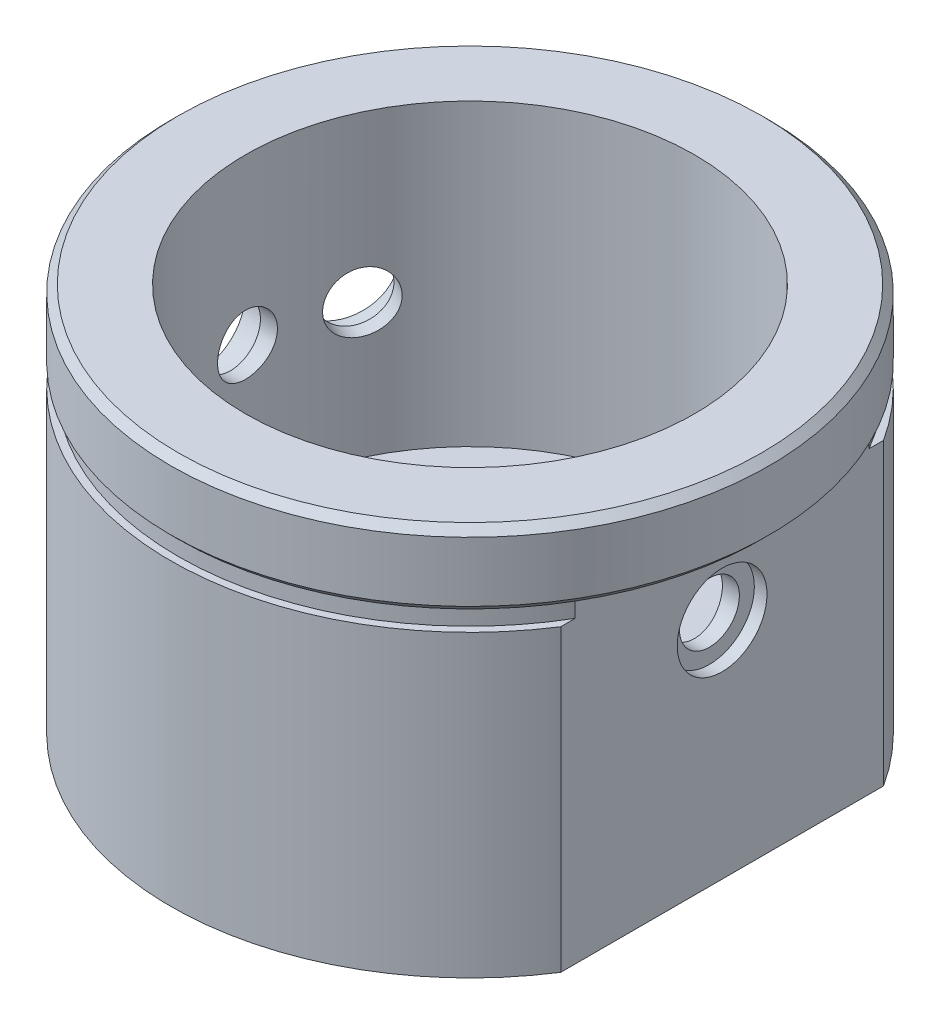
ISO-10303-21;
HEADER;
FILE_DESCRIPTION(('STEP AP214'),'2;1');
FILE_NAME('part.step','',(''),(''),'','','');
FILE_SCHEMA(('AUTOMOTIVE_DESIGN { 1 0 10303 214 1 1 1 1 }'));
ENDSEC;
DATA;
#1=APPLICATION_CONTEXT('core data for automotive mechanical design processes');
#2=APPLICATION_PROTOCOL_DEFINITION('international standard','automotive_design',2000,#1);
#3=PRODUCT_CONTEXT('',#1,'mechanical');
#4=PRODUCT('Part','Part','',(#3));
#5=PRODUCT_RELATED_PRODUCT_CATEGORY('part','',(#4));
#6=PRODUCT_DEFINITION_FORMATION('','',#4);
#7=PRODUCT_DEFINITION_CONTEXT('part definition',#1,'design');
#8=PRODUCT_DEFINITION('design','',#6,#7);
#9=PRODUCT_DEFINITION_SHAPE('','',#8);
#10=(LENGTH_UNIT() NAMED_UNIT(*) SI_UNIT(.MILLI.,.METRE.));
#11=(NAMED_UNIT(*) PLANE_ANGLE_UNIT() SI_UNIT($,.RADIAN.));
#12=(NAMED_UNIT(*) SI_UNIT($,.STERADIAN.) SOLID_ANGLE_UNIT());
#13=UNCERTAINTY_MEASURE_WITH_UNIT(LENGTH_MEASURE(1.E-05),#10,'distance_accuracy_value','');
#14=(GEOMETRIC_REPRESENTATION_CONTEXT(3) GLOBAL_UNCERTAINTY_ASSIGNED_CONTEXT((#13)) GLOBAL_UNIT_ASSIGNED_CONTEXT((#10,
#11,#12)) REPRESENTATION_CONTEXT('',''));
#15=CARTESIAN_POINT('',(0.,0.,0.));
#16=DIRECTION('',(0.,0.,1.));
#17=DIRECTION('',(1.,0.,0.));
#18=AXIS2_PLACEMENT_3D('',#15,#16,#17);
#19=CARTESIAN_POINT('',(0.,0.,0.));
#20=DIRECTION('',(0.,-1.,0.));
#21=DIRECTION('',(0.,0.,-1.));
#22=AXIS2_PLACEMENT_3D('',#19,#20,#21);
#23=CYLINDRICAL_SURFACE('',#22,19.5);
#24=CARTESIAN_POINT('',(0.,5.,0.));
#25=DIRECTION('',(0.,-1.,0.));
#26=DIRECTION('',(0.,0.,-1.));
#27=AXIS2_PLACEMENT_3D('',#24,#25,#26);
#28=CIRCLE('',#27,19.5);
#29=CARTESIAN_POINT('',(16.8456422437219,5.,9.82213507321768));
#30=VERTEX_POINT('',#29);
#31=CARTESIAN_POINT('',(-18.,5.,7.50000000000002));
#32=VERTEX_POINT('',#31);
#33=EDGE_CURVE('E145',#30,#32,#28,.T.);
#34=ORIENTED_EDGE('',*,*,#33,.F.);
#35=DIRECTION('',(0.,-1.,0.));
#36=VECTOR('',#35,1.);
#37=CARTESIAN_POINT('',(16.8456422437219,0.,9.82213507321768));
#38=LINE('',#37,#36);
#39=CARTESIAN_POINT('',(16.8456422437219,6.,9.82213507321769));
#40=VERTEX_POINT('',#39);
#41=EDGE_CURVE('E315',#30,#40,#38,.F.);
#42=ORIENTED_EDGE('',*,*,#41,.T.);
#43=CARTESIAN_POINT('',(0.,6.,0.));
#44=DIRECTION('',(0.,-1.,0.));
#45=DIRECTION('',(0.,0.,-1.));
#46=AXIS2_PLACEMENT_3D('',#43,#44,#45);
#47=CIRCLE('',#46,19.5);
#48=CARTESIAN_POINT('',(-18.,6.,7.50000000000006));
#49=VERTEX_POINT('',#48);
#50=EDGE_CURVE('E149',#40,#49,#47,.T.);
#51=ORIENTED_EDGE('',*,*,#50,.T.);
#52=DIRECTION('',(0.,-1.,0.));
#53=VECTOR('',#52,1.);
#54=CARTESIAN_POINT('',(-18.,0.,7.50000000000004));
#55=LINE('',#54,#53);
#56=EDGE_CURVE('E191',#49,#32,#55,.T.);
#57=ORIENTED_EDGE('',*,*,#56,.T.);
#58=EDGE_LOOP('',(#34,#42,#51,#57));
#59=FACE_BOUND('',#58,.T.);
#60=ADVANCED_FACE('F39',(#59),#23,.T.);
#61=CARTESIAN_POINT('',(-13.1439032036043,6.,-14.4044371141076));
#62=VERTEX_POINT('',#61);
#63=CARTESIAN_POINT('',(16.8456422437219,6.,-9.82213507321769));
#64=VERTEX_POINT('',#63);
#65=EDGE_CURVE('E154',#62,#64,#47,.T.);
#66=ORIENTED_EDGE('',*,*,#65,.T.);
#67=DIRECTION('',(0.,-1.,0.));
#68=VECTOR('',#67,1.);
#69=CARTESIAN_POINT('',(16.8456422437219,0.,-9.82213507321768));
#70=LINE('',#69,#68);
#71=CARTESIAN_POINT('',(16.8456422437219,5.,-9.82213507321768));
#72=VERTEX_POINT('',#71);
#73=EDGE_CURVE('E319',#64,#72,#70,.T.);
#74=ORIENTED_EDGE('',*,*,#73,.T.);
#75=CARTESIAN_POINT('',(-13.1439032036044,5.,-14.4044371141076));
#76=VERTEX_POINT('',#75);
#77=EDGE_CURVE('E146',#76,#72,#28,.T.);
#78=ORIENTED_EDGE('',*,*,#77,.F.);
#79=DIRECTION('',(0.,-1.,0.));
#80=VECTOR('',#79,1.);
#81=CARTESIAN_POINT('',(-13.1439032036043,0.,-14.4044371141076));
#82=LINE('',#81,#80);
#83=EDGE_CURVE('E197',#76,#62,#82,.F.);
#84=ORIENTED_EDGE('',*,*,#83,.T.);
#85=EDGE_LOOP('',(#66,#74,#78,#84));
#86=FACE_BOUND('',#85,.T.);
#87=ADVANCED_FACE('F277',(#86),#23,.T.);
#88=CARTESIAN_POINT('',(19.5,5.,0.));
#89=DIRECTION('',(0.,1.,0.));
#90=DIRECTION('',(0.,0.,1.));
#91=AXIS2_PLACEMENT_3D('',#88,#89,#90);
#92=PLANE('',#91);
#93=CARTESIAN_POINT('',(0.,5.,0.));
#94=DIRECTION('',(0.,-1.,0.));
#95=DIRECTION('',(0.,0.,-1.));
#96=AXIS2_PLACEMENT_3D('',#93,#94,#95);
#97=CIRCLE('',#96,20.);
#98=CARTESIAN_POINT('',(16.8456422437219,5.,10.7807391859989));
#99=VERTEX_POINT('',#98);
#100=CARTESIAN_POINT('',(-18.,5.,8.71779788708136));
#101=VERTEX_POINT('',#100);
#102=EDGE_CURVE('E138',#99,#101,#97,.T.);
#103=ORIENTED_EDGE('',*,*,#102,.F.);
#104=DIRECTION('',(0.,0.,-1.));
#105=VECTOR('',#104,1.);
#106=CARTESIAN_POINT('',(16.8456422437219,5.,0.));
#107=LINE('',#106,#105);
#108=EDGE_CURVE('E323',#99,#30,#107,.T.);
#109=ORIENTED_EDGE('',*,*,#108,.T.);
#110=ORIENTED_EDGE('',*,*,#33,.T.);
#111=DIRECTION('',(0.,0.,1.));
#112=VECTOR('',#111,1.);
#113=CARTESIAN_POINT('',(-18.,5.,0.));
#114=LINE('',#113,#112);
#115=EDGE_CURVE('E184',#32,#101,#114,.T.);
#116=ORIENTED_EDGE('',*,*,#115,.T.);
#117=EDGE_LOOP('',(#103,#109,#110,#116));
#118=FACE_BOUND('',#117,.T.);
#119=ADVANCED_FACE('F283',(#118),#92,.T.);
#120=ORIENTED_EDGE('',*,*,#77,.T.);
#121=CARTESIAN_POINT('',(16.8456422437219,5.,-10.7807391859989));
#122=VERTEX_POINT('',#121);
#123=EDGE_CURVE('E129',#72,#122,#107,.T.);
#124=ORIENTED_EDGE('',*,*,#123,.T.);
#125=CARTESIAN_POINT('',(-12.6292395774145,5.,-15.5081368222062));
#126=VERTEX_POINT('',#125);
#127=EDGE_CURVE('E128',#126,#122,#97,.T.);
#128=ORIENTED_EDGE('',*,*,#127,.F.);
#129=DIRECTION('',(-0.422618261740707,0.,0.906307787036646));
#130=VECTOR('',#129,1.);
#131=CARTESIAN_POINT('',(-12.8307193611033,5.,-15.0760620317429));
#132=LINE('',#131,#130);
#133=EDGE_CURVE('E194',#126,#76,#132,.T.);
#134=ORIENTED_EDGE('',*,*,#133,.T.);
#135=EDGE_LOOP('',(#120,#124,#128,#134));
#136=FACE_BOUND('',#135,.T.);
#137=ADVANCED_FACE('F321',(#136),#92,.T.);
#138=CARTESIAN_POINT('',(0.,0.,0.));
#139=DIRECTION('',(0.,-1.,0.));
#140=DIRECTION('',(0.,0.,-1.));
#141=AXIS2_PLACEMENT_3D('',#138,#139,#140);
#142=CYLINDRICAL_SURFACE('',#141,20.);
#143=CARTESIAN_POINT('',(0.,-15.,0.));
#144=DIRECTION('',(0.,-1.,0.));
#145=DIRECTION('',(0.,0.,-1.));
#146=AXIS2_PLACEMENT_3D('',#143,#144,#145);
#147=CIRCLE('',#146,20.);
#148=CARTESIAN_POINT('',(16.8456422437219,-15.,10.7807391859989));
#149=VERTEX_POINT('',#148);
#150=CARTESIAN_POINT('',(-18.,-15.,8.71779788708136));
#151=VERTEX_POINT('',#150);
#152=EDGE_CURVE('E135',#149,#151,#147,.T.);
#153=ORIENTED_EDGE('',*,*,#152,.F.);
#154=DIRECTION('',(0.,-1.,0.));
#155=VECTOR('',#154,1.);
#156=CARTESIAN_POINT('',(16.8456422437219,6.,10.7807391859989));
#157=LINE('',#156,#155);
#158=EDGE_CURVE('E116',#99,#149,#157,.T.);
#159=ORIENTED_EDGE('',*,*,#158,.F.);
#160=ORIENTED_EDGE('',*,*,#102,.T.);
#161=DIRECTION('',(0.,-1.,0.));
#162=VECTOR('',#161,1.);
#163=CARTESIAN_POINT('',(-18.,6.,8.71779788708136));
#164=LINE('',#163,#162);
#165=EDGE_CURVE('E176',#101,#151,#164,.T.);
#166=ORIENTED_EDGE('',*,*,#165,.T.);
#167=EDGE_LOOP('',(#153,#159,#160,#166));
#168=FACE_BOUND('',#167,.T.);
#169=ADVANCED_FACE('F331',(#168),#142,.T.);
#170=ORIENTED_EDGE('',*,*,#127,.T.);
#171=DIRECTION('',(0.,-1.,0.));
#172=VECTOR('',#171,1.);
#173=CARTESIAN_POINT('',(16.8456422437219,6.,-10.7807391859989));
#174=LINE('',#173,#172);
#175=CARTESIAN_POINT('',(16.8456422437219,-15.,-10.7807391859989));
#176=VERTEX_POINT('',#175);
#177=EDGE_CURVE('E113',#122,#176,#174,.T.);
#178=ORIENTED_EDGE('',*,*,#177,.T.);
#179=CARTESIAN_POINT('',(-12.6292395774145,-15.,-15.5081368222062));
#180=VERTEX_POINT('',#179);
#181=EDGE_CURVE('E126',#180,#176,#147,.T.);
#182=ORIENTED_EDGE('',*,*,#181,.F.);
#183=DIRECTION('',(0.,-1.,0.));
#184=VECTOR('',#183,1.);
#185=CARTESIAN_POINT('',(-12.6292395774145,6.,-15.5081368222062));
#186=LINE('',#185,#184);
#187=EDGE_CURVE('E180',#126,#180,#186,.T.);
#188=ORIENTED_EDGE('',*,*,#187,.F.);
#189=EDGE_LOOP('',(#170,#178,#182,#188));
#190=FACE_BOUND('',#189,.T.);
#191=ADVANCED_FACE('F124',(#190),#142,.T.);
#192=CARTESIAN_POINT('',(0.,-15.,0.));
#193=DIRECTION('',(0.,-1.,0.));
#194=DIRECTION('',(0.,0.,-1.));
#195=AXIS2_PLACEMENT_3D('',#192,#193,#194);
#196=PLANE('',#195);
#197=ORIENTED_EDGE('',*,*,#181,.T.);
#198=DIRECTION('',(0.,0.,1.));
#199=VECTOR('',#198,1.);
#200=CARTESIAN_POINT('',(16.8456422437219,-15.,-10.7807391859989));
#201=LINE('',#200,#199);
#202=EDGE_CURVE('E109',#176,#149,#201,.T.);
#203=ORIENTED_EDGE('',*,*,#202,.T.);
#204=ORIENTED_EDGE('',*,*,#152,.T.);
#205=DIRECTION('',(0.,0.,1.));
#206=VECTOR('',#205,1.);
#207=CARTESIAN_POINT('',(-18.,-15.,4.));
#208=LINE('',#207,#206);
#209=CARTESIAN_POINT('',(-18.,-15.,-3.99050392757301));
#210=VERTEX_POINT('',#209);
#211=EDGE_CURVE('E202',#210,#151,#208,.T.);
#212=ORIENTED_EDGE('',*,*,#211,.F.);
#213=DIRECTION('',(-0.422618261740706,0.,0.906307787036647));
#214=VECTOR('',#213,1.);
#215=CARTESIAN_POINT('',(-18.0040132136225,-15.,-3.98189756318601));
#216=LINE('',#215,#214);
#217=EDGE_CURVE('E133',#180,#210,#216,.T.);
#218=ORIENTED_EDGE('',*,*,#217,.F.);
#219=EDGE_LOOP('',(#197,#203,#204,#212,#218));
#220=FACE_BOUND('',#219,.T.);
#221=ADVANCED_FACE('F131',(#220),#196,.T.);
#222=CARTESIAN_POINT('',(16.,0.,0.));
#223=DIRECTION('',(1.,0.,0.));
#224=DIRECTION('',(0.,0.,-1.));
#225=AXIS2_PLACEMENT_3D('',#222,#223,#224);
#226=CYLINDRICAL_SURFACE('',#225,3.);
#227=CARTESIAN_POINT('',(16.,0.,0.));
#228=DIRECTION('',(1.,0.,0.));
#229=DIRECTION('',(0.,0.,-1.));
#230=AXIS2_PLACEMENT_3D('',#227,#228,#229);
#231=CIRCLE('',#230,3.);
#232=CARTESIAN_POINT('',(16.,0.,-3.00000000000002));
#233=VERTEX_POINT('',#232);
#234=EDGE_CURVE('E163',#233,#233,#231,.T.);
#235=ORIENTED_EDGE('',*,*,#234,.F.);
#236=EDGE_LOOP('',(#235));
#237=FACE_BOUND('',#236,.T.);
#238=CARTESIAN_POINT('',(16.8456422437219,0.,0.));
#239=DIRECTION('',(1.,0.,0.));
#240=DIRECTION('',(0.,0.,-1.));
#241=AXIS2_PLACEMENT_3D('',#238,#239,#240);
#242=CIRCLE('',#241,3.);
#243=CARTESIAN_POINT('',(16.8456422437219,0.,-3.00000000000001));
#244=VERTEX_POINT('',#243);
#245=EDGE_CURVE('E12',#244,#244,#242,.F.);
#246=ORIENTED_EDGE('',*,*,#245,.F.);
#247=EDGE_LOOP('',(#246));
#248=FACE_BOUND('',#247,.T.);
#249=ADVANCED_FACE('F233',(#237,#248),#226,.F.);
#250=CARTESIAN_POINT('',(-20.,0.,0.));
#251=DIRECTION('',(-1.,0.,0.));
#252=DIRECTION('',(0.,0.,1.));
#253=AXIS2_PLACEMENT_3D('',#250,#251,#252);
#254=CYLINDRICAL_SURFACE('',#253,1.99999999999999);
#255=CARTESIAN_POINT('',(-14.8660687473185,0.,1.99999999999999));
#256=CARTESIAN_POINT('',(-14.8660704451043,-0.111803855467527,1.99999528594758));
#257=CARTESIAN_POINT('',(-14.8673436464034,-0.223676033116217,1.99059326704127));
#258=CARTESIAN_POINT('',(-14.8722964859732,-0.444302462335889,1.95323796266129));
#259=CARTESIAN_POINT('',(-14.8759785863295,-0.553053404917202,1.92526569649112));
#260=CARTESIAN_POINT('',(-14.8853249214529,-0.764211368226314,1.85161311140263));
#261=CARTESIAN_POINT('',(-14.8909877556206,-0.866622811617689,1.80594530275044));
#262=CARTESIAN_POINT('',(-14.9036558225185,-1.06231107570956,1.69822564880686));
#263=CARTESIAN_POINT('',(-14.9106608397868,-1.15558935893803,1.63617643263468));
#264=CARTESIAN_POINT('',(-14.9252737732073,-1.33097345466846,1.49703370489517));
#265=CARTESIAN_POINT('',(-14.9328848849373,-1.41301286567938,1.41985682274859));
#266=CARTESIAN_POINT('',(-14.9478237625824,-1.56301624545638,1.2528292287261));
#267=CARTESIAN_POINT('',(-14.9551515139324,-1.63097949147619,1.16297786647198));
#268=CARTESIAN_POINT('',(-14.9687309976037,-1.7511418417164,0.972731724927607));
#269=CARTESIAN_POINT('',(-14.9749785650228,-1.80328048929024,0.872298437711217));
#270=CARTESIAN_POINT('',(-14.9856585341581,-1.88992616418079,0.664003816037362));
#271=CARTESIAN_POINT('',(-14.990091012146,-1.92443393237767,0.556142793922396));
#272=CARTESIAN_POINT('',(-14.9966188619561,-1.97463890958026,0.336735375014086));
#273=CARTESIAN_POINT('',(-14.9987279820508,-1.99044681501195,0.225214723469895));
#274=CARTESIAN_POINT('',(-15.0004184797152,-2.00314660873682,0.00108500230365441));
#275=CARTESIAN_POINT('',(-14.9999999696283,-2.00003933773651,-0.111524018722468));
#276=CARTESIAN_POINT('',(-14.9966934411691,-1.97508526945905,-0.33388012446577));
#277=CARTESIAN_POINT('',(-14.9938211133781,-1.95335753525435,-0.443640837361785));
#278=CARTESIAN_POINT('',(-14.9859472409229,-1.89196567297849,-0.657944122712554));
#279=CARTESIAN_POINT('',(-14.9809456511403,-1.85230116483188,-0.762486584541839));
#280=CARTESIAN_POINT('',(-14.9693481900416,-1.75603655887817,-0.963751808424127));
#281=CARTESIAN_POINT('',(-14.9627475214588,-1.69938537681691,-1.06044984935326));
#282=CARTESIAN_POINT('',(-14.9486895041904,-1.57079274271714,-1.24301169073478));
#283=CARTESIAN_POINT('',(-14.9412321108429,-1.49885049337219,-1.32887492586681));
#284=CARTESIAN_POINT('',(-14.9262258809566,-1.34105215164106,-1.48803006154538));
#285=CARTESIAN_POINT('',(-14.918676784244,-1.25509223180636,-1.56121903353021));
#286=CARTESIAN_POINT('',(-14.9043949876924,-1.07205406862742,-1.69214693057191));
#287=CARTESIAN_POINT('',(-14.8976622910907,-0.974975781197026,-1.74988579436353));
#288=CARTESIAN_POINT('',(-14.8857757633434,-0.772359999653296,-1.848282860865));
#289=CARTESIAN_POINT('',(-14.8806227621479,-0.666818095481509,-1.88893208906706));
#290=CARTESIAN_POINT('',(-14.8724947546572,-0.450321979361622,-1.95190090044923));
#291=CARTESIAN_POINT('',(-14.8695196283616,-0.339368065973433,-1.97422149354143));
#292=CARTESIAN_POINT('',(-14.8661064501035,-0.116108664995037,-1.99976160768726));
#293=CARTESIAN_POINT('',(-14.8656491151163,-0.00382006966746272,-2.00312631098811));
#294=CARTESIAN_POINT('',(-14.867272242967,0.219719256104743,-1.99104288188795));
#295=CARTESIAN_POINT('',(-14.8693526440475,0.330970011739454,-1.97559520729776));
#296=CARTESIAN_POINT('',(-14.8757992043677,0.548835986405613,-1.92644805037019));
#297=CARTESIAN_POINT('',(-14.8801564778765,0.655467493018102,-1.89281950323359));
#298=CARTESIAN_POINT('',(-14.8906585901441,0.861578913452434,-1.80833845080125));
#299=CARTESIAN_POINT('',(-14.8968034998284,0.961058543323716,-1.75748526209382));
#300=CARTESIAN_POINT('',(-14.9102344661952,1.15069731044081,-1.6396440641721));
#301=CARTESIAN_POINT('',(-14.9175271378913,1.24079704836823,-1.572561231663));
#302=CARTESIAN_POINT('',(-14.9324114351651,1.40851093843708,-1.42429832312798));
#303=CARTESIAN_POINT('',(-14.9400030739993,1.48612453614801,-1.34311762143753));
#304=CARTESIAN_POINT('',(-14.9546894865533,1.62717655392111,-1.16832754835823));
#305=CARTESIAN_POINT('',(-14.9617807004972,1.69051931637161,-1.07464064093252));
#306=CARTESIAN_POINT('',(-14.974613414783,1.80056828217532,-0.877872452317617));
#307=CARTESIAN_POINT('',(-14.9803549454849,1.8472748597561,-0.774791382513696));
#308=CARTESIAN_POINT('',(-14.9898256469115,1.92256926158812,-0.56247277252343));
#309=CARTESIAN_POINT('',(-14.9935608482078,1.95121142908354,-0.453254784247359));
#310=CARTESIAN_POINT('',(-14.9986231668662,1.98974048546097,-0.231506493423197));
#311=CARTESIAN_POINT('',(-14.9999504085613,1.99962834270771,-0.118976362199823));
#312=CARTESIAN_POINT('',(-15.0000464724842,2.00034826724031,0.105269873711589));
#313=CARTESIAN_POINT('',(-14.9988350491343,1.99132747059439,0.21698552592188));
#314=CARTESIAN_POINT('',(-14.9940293321986,1.95479895876801,0.437297443052352));
#315=CARTESIAN_POINT('',(-14.9904350419501,1.92729126947869,0.545893712341046));
#316=CARTESIAN_POINT('',(-14.9812655664247,1.85461795292333,0.756858234588857));
#317=CARTESIAN_POINT('',(-14.9756912840831,1.80946037359193,0.859229301543908));
#318=CARTESIAN_POINT('',(-14.9631774939599,1.70278445035426,1.05496407863087));
#319=CARTESIAN_POINT('',(-14.95623796097,1.64126580434755,1.14832762239916));
#320=CARTESIAN_POINT('',(-14.9417029120984,1.50307331799635,1.32414728606673));
#321=CARTESIAN_POINT('',(-14.9341029029987,1.4262902098608,1.40651715716399));
#322=CARTESIAN_POINT('',(-14.919138648968,1.25997693095263,1.55725895587216));
#323=CARTESIAN_POINT('',(-14.9117744601021,1.17044375607873,1.62562757530231));
#324=CARTESIAN_POINT('',(-14.8980810988492,0.980716058429105,1.74668790978495));
#325=CARTESIAN_POINT('',(-14.8917566176026,0.880476408489894,1.79930940429125));
#326=CARTESIAN_POINT('',(-14.8809136658427,0.672551532482942,1.8868951828149));
#327=CARTESIAN_POINT('',(-14.8763932602426,0.564874430240623,1.92187839666365));
#328=CARTESIAN_POINT('',(-14.8707513382361,0.380551721274456,1.96495480378582));
#329=CARTESIAN_POINT('',(-14.8690042861798,0.305061727031858,1.97807748135802));
#330=CARTESIAN_POINT('',(-14.866662414787,0.153058490529495,1.99560165343181));
#331=CARTESIAN_POINT('',(-14.8660675849485,0.0765452576025887,2.00000322742319));
#332=CARTESIAN_POINT('',(-14.8660687473185,0.,1.99999999999999));
#333=B_SPLINE_CURVE_WITH_KNOTS('',3,(#255,#256,#257,#258,#259,#260,#261,#262,#263,#264,#265,
#266,#267,#268,#269,#270,#271,#272,#273,#274,#275,#276,#277,#278,#279,#280,#281,#282,#283,#284,
#285,#286,#287,#288,#289,#290,#291,#292,#293,#294,#295,#296,#297,#298,#299,#300,#301,#302,#303,
#304,#305,#306,#307,#308,#309,#310,#311,#312,#313,#314,#315,#316,#317,#318,#319,#320,#321,#322,
#323,#324,#325,#326,#327,#328,#329,#330,#331,#332),.UNSPECIFIED.,.T.,.F.,(4,2,2,2,2,2,2,2,2,2,2,
2,2,2,2,2,2,2,2,2,2,2,2,2,2,2,2,2,2,2,2,2,2,2,2,2,2,2,4),(0.,0.335131889250448,
0.670606846105681,1.00584506276824,1.34102950834956,1.67811595121165,2.01521969762238,
2.35359556525146,2.69195721256927,3.02830569524968,3.36463922864855,3.69883808669951,
4.03304402666677,4.3682652845625,4.70350402584627,5.04134915068957,5.37919561519089,
5.71721927655739,6.05522431149099,6.39063702581928,6.7260415778354,7.06014684818593,
7.39426537618207,7.7303852814233,8.06652010750619,8.40484511764501,8.74316251675149,
9.08045723770332,9.41773454222144,9.75239709856297,10.0870591862064,10.4215688535019,
10.7560846978107,11.0930874236894,11.430169684094,11.768733419821,12.1069330231323,
12.3363794094425,12.56582370442),.UNSPECIFIED.);
#334=CARTESIAN_POINT('',(-14.8660687473185,0.,1.99999999999999));
#335=VERTEX_POINT('',#334);
#336=EDGE_CURVE('E219',#335,#335,#333,.T.);
#337=ORIENTED_EDGE('',*,*,#336,.T.);
#338=EDGE_LOOP('',(#337));
#339=FACE_BOUND('',#338,.T.);
#340=CARTESIAN_POINT('',(-16.,0.,0.));
#341=DIRECTION('',(-1.,0.,0.));
#342=DIRECTION('',(0.,0.,1.));
#343=AXIS2_PLACEMENT_3D('',#340,#341,#342);
#344=CIRCLE('',#343,1.99999999999999);
#345=CARTESIAN_POINT('',(-16.,0.,1.99999999999999));
#346=VERTEX_POINT('',#345);
#347=EDGE_CURVE('E173',#346,#346,#344,.F.);
#348=ORIENTED_EDGE('',*,*,#347,.F.);
#349=EDGE_LOOP('',(#348));
#350=FACE_BOUND('',#349,.T.);
#351=ADVANCED_FACE('F236',(#339,#350),#254,.F.);
#352=CARTESIAN_POINT('',(-16.3135401666596,0.,-7.60712871133272));
#353=DIRECTION('',(-0.906307787036647,0.,-0.422618261740706));
#354=DIRECTION('',(-0.422618261740706,0.,0.906307787036647));
#355=AXIS2_PLACEMENT_3D('',#352,#353,#354);
#356=PLANE('',#355);
#357=CARTESIAN_POINT('',(-16.3135401666597,0.,-7.6071287113326));
#358=DIRECTION('',(-0.906307787036647,0.,-0.422618261740706));
#359=DIRECTION('',(-0.422618261740706,0.,0.906307787036647));
#360=AXIS2_PLACEMENT_3D('',#357,#358,#359);
#361=CIRCLE('',#360,3.);
#362=CARTESIAN_POINT('',(-17.5813949518818,0.,-4.88820535022266));
#363=VERTEX_POINT('',#362);
#364=EDGE_CURVE('E168',#363,#363,#361,.F.);
#365=ORIENTED_EDGE('',*,*,#364,.T.);
#366=EDGE_LOOP('',(#365));
#367=FACE_BOUND('',#366,.T.);
#368=DIRECTION('',(0.,1.,0.));
#369=VECTOR('',#368,1.);
#370=CARTESIAN_POINT('',(-18.,0.,-3.99050392757301));
#371=LINE('',#370,#369);
#372=CARTESIAN_POINT('',(-18.,6.,-3.99050392757301));
#373=VERTEX_POINT('',#372);
#374=EDGE_CURVE('E61',#210,#373,#371,.T.);
#375=ORIENTED_EDGE('',*,*,#374,.T.);
#376=DIRECTION('',(0.422618261740706,0.,-0.906307787036647));
#377=VECTOR('',#376,1.);
#378=CARTESIAN_POINT('',(-18.0040132136225,6.,-3.98189756318601));
#379=LINE('',#378,#377);
#380=EDGE_CURVE('E206',#373,#62,#379,.T.);
#381=ORIENTED_EDGE('',*,*,#380,.T.);
#382=ORIENTED_EDGE('',*,*,#83,.F.);
#383=ORIENTED_EDGE('',*,*,#133,.F.);
#384=ORIENTED_EDGE('',*,*,#187,.T.);
#385=ORIENTED_EDGE('',*,*,#217,.T.);
#386=EDGE_LOOP('',(#375,#381,#382,#383,#384,#385));
#387=FACE_BOUND('',#386,.T.);
#388=ADVANCED_FACE('F246',(#367,#387),#356,.T.);
#389=CARTESIAN_POINT('',(-14.5009245925864,0.,-6.76189218785118));
#390=DIRECTION('',(-0.906307787036647,0.,-0.422618261740706));
#391=DIRECTION('',(-0.422618261740706,0.,0.906307787036647));
#392=AXIS2_PLACEMENT_3D('',#389,#390,#391);
#393=CYLINDRICAL_SURFACE('',#392,3.);
#394=CARTESIAN_POINT('',(-14.5009245925864,0.,-6.76189218785118));
#395=DIRECTION('',(-0.906307787036647,0.,-0.422618261740706));
#396=DIRECTION('',(-0.422618261740706,0.,0.906307787036647));
#397=AXIS2_PLACEMENT_3D('',#394,#395,#396);
#398=CIRCLE('',#397,3.);
#399=CARTESIAN_POINT('',(-15.7687793778085,0.,-4.04296882674124));
#400=VERTEX_POINT('',#399);
#401=EDGE_CURVE('E167',#400,#400,#398,.T.);
#402=ORIENTED_EDGE('',*,*,#401,.F.);
#403=EDGE_LOOP('',(#402));
#404=FACE_BOUND('',#403,.T.);
#405=ORIENTED_EDGE('',*,*,#364,.F.);
#406=EDGE_LOOP('',(#405));
#407=FACE_BOUND('',#406,.T.);
#408=ADVANCED_FACE('F231',(#404,#407),#393,.F.);
#409=CARTESIAN_POINT('',(-18.126155740733,0.,-8.45236523481401));
#410=DIRECTION('',(-0.906307787036649,0.,-0.4226182617407));
#411=DIRECTION('',(-0.4226182617407,0.,0.906307787036649));
#412=AXIS2_PLACEMENT_3D('',#409,#410,#411);
#413=CYLINDRICAL_SURFACE('',#412,2.);
#414=CARTESIAN_POINT('',(-14.3184703917983,0.,-4.4700565588362));
#415=CARTESIAN_POINT('',(-14.3184699382702,-0.111803855467527,-4.47006154873388));
#416=CARTESIAN_POINT('',(-14.315650385635,-0.223676033116218,-4.47912074980244));
#417=CARTESIAN_POINT('',(-14.3043521489012,-0.44430246233589,-4.51506931349878));
#418=CARTESIAN_POINT('',(-14.295867674621,-0.553053404917203,-4.54197691900201));
#419=CARTESIAN_POINT('',(-14.2732114034407,-0.764211368226316,-4.61267876230658));
#420=CARTESIAN_POINT('',(-14.2590436242335,-0.866622811617691,-4.65646107003743));
#421=CARTESIAN_POINT('',(-14.2250004990048,-1.06231107570956,-4.7594419876354));
#422=CARTESIAN_POINT('',(-14.2051260688224,-1.15558935893803,-4.81863812365316));
#423=CARTESIAN_POINT('',(-14.1595656264417,-1.33097345466847,-4.95091995383412));
#424=CARTESIAN_POINT('',(-14.1338472764913,-1.41301286567938,-5.02408255791202));
#425=CARTESIAN_POINT('',(-14.076797586182,-1.56301624545638,-5.1817744095273));
#426=CARTESIAN_POINT('',(-14.0454659577612,-1.63097949147619,-5.26630424035211));
#427=CARTESIAN_POINT('',(-13.977371655914,-1.7511418417164,-5.44446473767191));
#428=CARTESIAN_POINT('',(-13.9405889336517,-1.80328048929025,-5.53812854403659));
#429=CARTESIAN_POINT('',(-13.8622391619026,-1.8899261641808,-5.73142113164887));
#430=CARTESIAN_POINT('',(-13.8206723135431,-1.92443393237768,-5.83104966205183));
#431=CARTESIAN_POINT('',(-13.7338629726666,-1.97463890958027,-6.0326591028817));
#432=CARTESIAN_POINT('',(-13.6886438207284,-1.99044681501196,-6.13462249045982));
#433=CARTESIAN_POINT('',(-13.5954546187619,-2.00314660873682,-6.33846743724354));
#434=CARTESIAN_POINT('',(-13.5474846910888,-2.00003933773652,-6.44034899988466));
#435=CARTESIAN_POINT('',(-13.4505162077015,-1.97508526945905,-6.64047467070512));
#436=CARTESIAN_POINT('',(-13.4015261129661,-1.95335753525435,-6.7387377613353));
#437=CARTESIAN_POINT('',(-13.3038214791055,-1.89196567297849,-6.92963485534606));
#438=CARTESIAN_POINT('',(-13.2551069458416,-1.85230116483189,-7.02226873939808));
#439=CARTESIAN_POINT('',(-13.1595377174721,-1.75603655887818,-7.19977568021214));
#440=CARTESIAN_POINT('',(-13.1126891221646,-1.69938537681692,-7.28462430461458));
#441=CARTESIAN_POINT('',(-13.0227942635791,-1.57079274271714,-7.44414034825293));
#442=CARTESIAN_POINT('',(-12.9797481987383,-1.4988504933722,-7.5188072362596));
#443=CARTESIAN_POINT('',(-12.8988860689507,-1.34105215164107,-7.65670886828214));
#444=CARTESIAN_POINT('',(-12.8611132676962,-1.25509223180637,-7.7198502173868));
#445=CARTESIAN_POINT('',(-12.7928370440074,-1.07205406862743,-7.83247544198284));
#446=CARTESIAN_POINT('',(-12.7623336503991,-0.97497578119703,-7.88195926331723));
#447=CARTESIAN_POINT('',(-12.7099764005357,-0.772359999653299,-7.96611382721436));
#448=CARTESIAN_POINT('',(-12.6881270892617,-0.666818095481513,-8.00077678686291));
#449=CARTESIAN_POINT('',(-12.6541488431696,-0.450321979361624,-8.05441086656189));
#450=CARTESIAN_POINT('',(-12.6420193727868,-0.339368065973434,-8.07338285118914));
#451=CARTESIAN_POINT('',(-12.628132264108,-0.116108664995038,-8.09508758405884));
#452=CARTESIAN_POINT('',(-12.6262957927875,-0.00382006966746323,-8.09794376274415));
#453=CARTESIAN_POINT('',(-12.6328735240001,0.219719256104742,-8.08767842032741));
#454=CARTESIAN_POINT('',(-12.6412874770828,0.330970011739454,-8.07455728804308));
#455=CARTESIAN_POINT('',(-12.6679005309308,0.548835986405614,-8.03273927112565));
#456=CARTESIAN_POINT('',(-12.6860615999778,0.655467493018103,-8.00410292034524));
#457=CARTESIAN_POINT('',(-12.7312829816353,0.861578913452436,-7.93197546909988));
#458=CARTESIAN_POINT('',(-12.7583436473483,0.961058543323718,-7.88848377922805));
#459=CARTESIAN_POINT('',(-12.8203180789811,1.15069731044081,-7.78735955557728));
#460=CARTESIAN_POINT('',(-12.8552779141952,1.24079704836824,-7.72964387833348));
#461=CARTESIAN_POINT('',(-12.9314262814047,1.40851093843709,-7.60156242564057));
#462=CARTESIAN_POINT('',(-12.9726150898318,1.48612453614801,-7.5311960887493));
#463=CARTESIAN_POINT('',(-13.0597949767475,1.62717655392112,-7.3789892305656));
#464=CARTESIAN_POINT('',(-13.1058155971284,1.69051931637161,-7.29707693333287));
#465=CARTESIAN_POINT('',(-13.2006038158528,1.80056828217532,-7.12416773115499));
#466=CARTESIAN_POINT('',(-13.2493713523764,1.8472748597561,-7.03317103062059));
#467=CARTESIAN_POINT('',(-13.3476844447173,1.92256926158813,-6.844747512428));
#468=CARTESIAN_POINT('',(-13.3972272030943,1.95121142908355,-6.74734096344801));
#469=CARTESIAN_POINT('',(-13.4955300991269,1.98974048546098,-6.54850818902377));
#470=CARTESIAN_POINT('',(-13.5442902770615,1.99962834270771,-6.44708217139785));
#471=CARTESIAN_POINT('',(-13.6391478949657,2.00034826724032,-6.24388665994581));
#472=CARTESIAN_POINT('',(-13.6852630472966,1.99132747059439,-6.14212592478337));
#473=CARTESIAN_POINT('',(-13.774015428074,1.95479895876802,-5.94042453497328));
#474=CARTESIAN_POINT('',(-13.8166526613912,1.92729126947869,-5.84048387777679));
#475=CARTESIAN_POINT('',(-13.8974997540008,1.85461795292333,-5.64540990066751));
#476=CARTESIAN_POINT('',(-13.9357116208766,1.80946037359194,-5.55027441200526));
#477=CARTESIAN_POINT('',(-14.0070913666972,1.70278445035426,-5.36758990310778));
#478=CARTESIAN_POINT('',(-14.0402591524874,1.64126580434756,-5.28004102299577));
#479=CARTESIAN_POINT('',(-14.1013905251492,1.50307331799635,-5.11455151561127));
#480=CARTESIAN_POINT('',(-14.1293135894635,1.4262902098608,-5.03668715738368));
#481=CARTESIAN_POINT('',(-14.17945760645,1.25997693095264,-4.89374452435587));
#482=CARTESIAN_POINT('',(-14.2016772118367,1.17044375607874,-4.8286692714797));
#483=CARTESIAN_POINT('',(-14.2404291200274,0.98071605842911,-4.71316428310675));
#484=CARTESIAN_POINT('',(-14.2569359979631,0.880476408489897,-4.66280017159935));
#485=CARTESIAN_POINT('',(-14.2841242958215,0.672551532482946,-4.57883806906478));
#486=CARTESIAN_POINT('',(-14.2948119620524,0.564874430240626,-4.545222103981));
#487=CARTESIAN_POINT('',(-14.307903520504,0.380551721274458,-4.50379724149735));
#488=CARTESIAN_POINT('',(-14.311866036806,0.305061727031861,-4.4911657205237));
#489=CARTESIAN_POINT('',(-14.3171496156668,0.153058490529496,-4.47429370929464));
#490=CARTESIAN_POINT('',(-14.3184707023013,0.0765452576025893,-4.47005314255863));
#491=CARTESIAN_POINT('',(-14.3184703917983,0.,-4.4700565588362));
#492=B_SPLINE_CURVE_WITH_KNOTS('',3,(#414,#415,#416,#417,#418,#419,#420,#421,#422,#423,#424,
#425,#426,#427,#428,#429,#430,#431,#432,#433,#434,#435,#436,#437,#438,#439,#440,#441,#442,#443,
#444,#445,#446,#447,#448,#449,#450,#451,#452,#453,#454,#455,#456,#457,#458,#459,#460,#461,#462,
#463,#464,#465,#466,#467,#468,#469,#470,#471,#472,#473,#474,#475,#476,#477,#478,#479,#480,#481,
#482,#483,#484,#485,#486,#487,#488,#489,#490,#491),.UNSPECIFIED.,.T.,.F.,(4,2,2,2,2,2,2,2,2,2,2,
2,2,2,2,2,2,2,2,2,2,2,2,2,2,2,2,2,2,2,2,2,2,2,2,2,2,2,4),(0.,0.335131889250449,
0.670606846105682,1.00584506276824,1.34102950834956,1.67811595121165,2.01521969762238,
2.35359556525146,2.69195721256927,3.02830569524968,3.36463922864856,3.69883808669952,
4.03304402666678,4.36826528456251,4.70350402584628,5.04134915068958,5.3791956151909,
5.7172192765574,6.05522431149101,6.3906370258193,6.72604157783542,7.06014684818595,
7.39426537618209,7.73038528142332,8.06652010750621,8.40484511764503,8.74316251675152,
9.08045723770334,9.41773454222146,9.75239709856299,10.0870591862064,10.4215688535019,
10.7560846978108,11.0930874236894,11.430169684094,11.768733419821,12.1069330231324,
12.3363794094425,12.5658237044201),.UNSPECIFIED.);
#493=CARTESIAN_POINT('',(-14.3184703917983,0.,-4.4700565588362));
#494=VERTEX_POINT('',#493);
#495=EDGE_CURVE('E162',#494,#494,#492,.T.);
#496=ORIENTED_EDGE('',*,*,#495,.T.);
#497=EDGE_LOOP('',(#496));
#498=FACE_BOUND('',#497,.T.);
#499=CARTESIAN_POINT('',(-14.5009245925864,0.,-6.76189218785121));
#500=DIRECTION('',(-0.906307787036647,0.,-0.422618261740706));
#501=DIRECTION('',(-0.422618261740706,0.,0.906307787036647));
#502=AXIS2_PLACEMENT_3D('',#499,#500,#501);
#503=CIRCLE('',#502,2.);
#504=CARTESIAN_POINT('',(-15.3461611160678,0.,-4.94927661377791));
#505=VERTEX_POINT('',#504);
#506=EDGE_CURVE('E164',#505,#505,#503,.F.);
#507=ORIENTED_EDGE('',*,*,#506,.F.);
#508=EDGE_LOOP('',(#507));
#509=FACE_BOUND('',#508,.T.);
#510=ADVANCED_FACE('F226',(#498,#509),#413,.F.);
#511=CARTESIAN_POINT('',(14.8660687473185,0.,1.99999999999999));
#512=CARTESIAN_POINT('',(14.8660704451043,0.111803855467527,1.99999528594757));
#513=CARTESIAN_POINT('',(14.8673436464034,0.223676033116217,1.99059326704126));
#514=CARTESIAN_POINT('',(14.8722964859732,0.444302462335889,1.95323796266129));
#515=CARTESIAN_POINT('',(14.8759785863295,0.553053404917202,1.92526569649112));
#516=CARTESIAN_POINT('',(14.8853249214529,0.764211368226314,1.85161311140263));
#517=CARTESIAN_POINT('',(14.8909877556206,0.86662281161769,1.80594530275043));
#518=CARTESIAN_POINT('',(14.9036558225185,1.06231107570956,1.69822564880685));
#519=CARTESIAN_POINT('',(14.9106608397868,1.15558935893803,1.63617643263468));
#520=CARTESIAN_POINT('',(14.9252737732073,1.33097345466846,1.49703370489516));
#521=CARTESIAN_POINT('',(14.9328848849373,1.41301286567938,1.41985682274858));
#522=CARTESIAN_POINT('',(14.9478237625824,1.56301624545638,1.25282922872609));
#523=CARTESIAN_POINT('',(14.9551515139324,1.63097949147619,1.16297786647197));
#524=CARTESIAN_POINT('',(14.9687309976037,1.7511418417164,0.972731724927601));
#525=CARTESIAN_POINT('',(14.9749785650228,1.80328048929024,0.872298437711211));
#526=CARTESIAN_POINT('',(14.9856585341581,1.88992616418079,0.664003816037357));
#527=CARTESIAN_POINT('',(14.990091012146,1.92443393237767,0.55614279392239));
#528=CARTESIAN_POINT('',(14.9966188619561,1.97463890958026,0.33673537501408));
#529=CARTESIAN_POINT('',(14.9987279820508,1.99044681501195,0.225214723469889));
#530=CARTESIAN_POINT('',(15.0004184797152,2.00314660873682,0.00108500230364896));
#531=CARTESIAN_POINT('',(14.9999999696283,2.00003933773651,-0.111524018722473));
#532=CARTESIAN_POINT('',(14.9966934411691,1.97508526945905,-0.333880124465776));
#533=CARTESIAN_POINT('',(14.9938211133781,1.95335753525435,-0.44364083736179));
#534=CARTESIAN_POINT('',(14.9859472409229,1.89196567297849,-0.65794412271256));
#535=CARTESIAN_POINT('',(14.9809456511403,1.85230116483188,-0.762486584541844));
#536=CARTESIAN_POINT('',(14.9693481900416,1.75603655887817,-0.963751808424133));
#537=CARTESIAN_POINT('',(14.9627475214588,1.69938537681691,-1.06044984935326));
#538=CARTESIAN_POINT('',(14.9486895041904,1.57079274271714,-1.24301169073479));
#539=CARTESIAN_POINT('',(14.9412321108429,1.49885049337219,-1.32887492586682));
#540=CARTESIAN_POINT('',(14.9262258809566,1.34105215164106,-1.48803006154539));
#541=CARTESIAN_POINT('',(14.918676784244,1.25509223180636,-1.56121903353021));
#542=CARTESIAN_POINT('',(14.9043949876924,1.07205406862742,-1.69214693057191));
#543=CARTESIAN_POINT('',(14.8976622910907,0.974975781197026,-1.74988579436353));
#544=CARTESIAN_POINT('',(14.8857757633434,0.772359999653296,-1.848282860865));
#545=CARTESIAN_POINT('',(14.8806227621479,0.666818095481509,-1.88893208906707));
#546=CARTESIAN_POINT('',(14.8724947546572,0.450321979361622,-1.95190090044924));
#547=CARTESIAN_POINT('',(14.8695196283616,0.339368065973433,-1.97422149354143));
#548=CARTESIAN_POINT('',(14.8661064501035,0.116108664995037,-1.99976160768727));
#549=CARTESIAN_POINT('',(14.8656491151163,0.00382006966746277,-2.00312631098812));
#550=CARTESIAN_POINT('',(14.867272242967,-0.219719256104742,-1.99104288188796));
#551=CARTESIAN_POINT('',(14.8693526440475,-0.330970011739453,-1.97559520729776));
#552=CARTESIAN_POINT('',(14.8757992043677,-0.548835986405613,-1.9264480503702));
#553=CARTESIAN_POINT('',(14.8801564778765,-0.655467493018102,-1.8928195032336));
#554=CARTESIAN_POINT('',(14.8906585901441,-0.861578913452434,-1.80833845080125));
#555=CARTESIAN_POINT('',(14.8968034998284,-0.961058543323715,-1.75748526209383));
#556=CARTESIAN_POINT('',(14.9102344661952,-1.15069731044081,-1.63964406417211));
#557=CARTESIAN_POINT('',(14.9175271378913,-1.24079704836823,-1.572561231663));
#558=CARTESIAN_POINT('',(14.9324114351651,-1.40851093843708,-1.42429832312799));
#559=CARTESIAN_POINT('',(14.9400030739993,-1.48612453614801,-1.34311762143754));
#560=CARTESIAN_POINT('',(14.9546894865533,-1.62717655392111,-1.16832754835824));
#561=CARTESIAN_POINT('',(14.9617807004972,-1.69051931637161,-1.07464064093252));
#562=CARTESIAN_POINT('',(14.974613414783,-1.80056828217532,-0.877872452317622));
#563=CARTESIAN_POINT('',(14.9803549454849,-1.8472748597561,-0.774791382513702));
#564=CARTESIAN_POINT('',(14.9898256469115,-1.92256926158812,-0.562472772523437));
#565=CARTESIAN_POINT('',(14.9935608482078,-1.95121142908354,-0.453254784247366));
#566=CARTESIAN_POINT('',(14.9986231668662,-1.98974048546097,-0.231506493423203));
#567=CARTESIAN_POINT('',(14.9999504085613,-1.99962834270771,-0.118976362199829));
#568=CARTESIAN_POINT('',(15.0000464724842,-2.00034826724031,0.105269873711583));
#569=CARTESIAN_POINT('',(14.9988350491343,-1.99132747059439,0.216985525921874));
#570=CARTESIAN_POINT('',(14.9940293321986,-1.95479895876801,0.437297443052346));
#571=CARTESIAN_POINT('',(14.9904350419501,-1.92729126947869,0.545893712341039));
#572=CARTESIAN_POINT('',(14.9812655664247,-1.85461795292333,0.756858234588851));
#573=CARTESIAN_POINT('',(14.9756912840831,-1.80946037359193,0.859229301543902));
#574=CARTESIAN_POINT('',(14.9631774939599,-1.70278445035426,1.05496407863087));
#575=CARTESIAN_POINT('',(14.95623796097,-1.64126580434755,1.14832762239916));
#576=CARTESIAN_POINT('',(14.9417029120984,-1.50307331799635,1.32414728606673));
#577=CARTESIAN_POINT('',(14.9341029029987,-1.4262902098608,1.40651715716399));
#578=CARTESIAN_POINT('',(14.919138648968,-1.25997693095263,1.55725895587215));
#579=CARTESIAN_POINT('',(14.9117744601021,-1.17044375607874,1.62562757530231));
#580=CARTESIAN_POINT('',(14.8980810988492,-0.980716058429107,1.74668790978494));
#581=CARTESIAN_POINT('',(14.8917566176026,-0.880476408489895,1.79930940429125));
#582=CARTESIAN_POINT('',(14.8809136658427,-0.672551532482944,1.88689518281489));
#583=CARTESIAN_POINT('',(14.8763932602426,-0.564874430240625,1.92187839666365));
#584=CARTESIAN_POINT('',(14.8707513382361,-0.380551721274456,1.96495480378581));
#585=CARTESIAN_POINT('',(14.8690042861798,-0.305061727031859,1.97807748135801));
#586=CARTESIAN_POINT('',(14.866662414787,-0.153058490529495,1.9956016534318));
#587=CARTESIAN_POINT('',(14.8660675849485,-0.0765452576025887,2.00000322742318));
#588=CARTESIAN_POINT('',(14.8660687473185,0.,1.99999999999999));
#589=B_SPLINE_CURVE_WITH_KNOTS('',3,(#511,#512,#513,#514,#515,#516,#517,#518,#519,#520,#521,
#522,#523,#524,#525,#526,#527,#528,#529,#530,#531,#532,#533,#534,#535,#536,#537,#538,#539,#540,
#541,#542,#543,#544,#545,#546,#547,#548,#549,#550,#551,#552,#553,#554,#555,#556,#557,#558,#559,
#560,#561,#562,#563,#564,#565,#566,#567,#568,#569,#570,#571,#572,#573,#574,#575,#576,#577,#578,
#579,#580,#581,#582,#583,#584,#585,#586,#587,#588),.UNSPECIFIED.,.T.,.F.,(4,2,2,2,2,2,2,2,2,2,2,
2,2,2,2,2,2,2,2,2,2,2,2,2,2,2,2,2,2,2,2,2,2,2,2,2,2,2,4),(0.,0.335131889250448,
0.670606846105681,1.00584506276824,1.34102950834956,1.67811595121165,2.01521969762238,
2.35359556525146,2.69195721256927,3.02830569524968,3.36463922864855,3.69883808669951,
4.03304402666677,4.3682652845625,4.70350402584627,5.04134915068957,5.37919561519089,
5.71721927655739,6.05522431149099,6.39063702581928,6.7260415778354,7.06014684818592,
7.39426537618207,7.7303852814233,8.06652010750619,8.40484511764501,8.74316251675149,
9.08045723770332,9.41773454222144,9.75239709856297,10.0870591862064,10.4215688535019,
10.7560846978107,11.0930874236894,11.430169684094,11.768733419821,12.1069330231323,
12.3363794094425,12.56582370442),.UNSPECIFIED.);
#590=CARTESIAN_POINT('',(14.8660687473185,0.,1.99999999999999));
#591=VERTEX_POINT('',#590);
#592=EDGE_CURVE('E358',#591,#591,#589,.T.);
#593=ORIENTED_EDGE('',*,*,#592,.T.);
#594=EDGE_LOOP('',(#593));
#595=FACE_BOUND('',#594,.T.);
#596=CARTESIAN_POINT('',(16.,0.,0.));
#597=DIRECTION('',(1.,0.,0.));
#598=DIRECTION('',(0.,0.,-1.));
#599=AXIS2_PLACEMENT_3D('',#596,#597,#598);
#600=CIRCLE('',#599,1.99999999999999);
#601=CARTESIAN_POINT('',(16.,0.,-2.));
#602=VERTEX_POINT('',#601);
#603=EDGE_CURVE('E159',#602,#602,#600,.F.);
#604=ORIENTED_EDGE('',*,*,#603,.F.);
#605=EDGE_LOOP('',(#604));
#606=FACE_BOUND('',#605,.T.);
#607=ADVANCED_FACE('F230',(#595,#606),#254,.F.);
#608=CARTESIAN_POINT('',(0.,10.5,0.));
#609=DIRECTION('',(0.,-1.,0.));
#610=DIRECTION('',(0.,0.,-1.));
#611=AXIS2_PLACEMENT_3D('',#608,#609,#610);
#612=CONICAL_SURFACE('',#611,20.,0.785398163397459);
#613=CARTESIAN_POINT('',(0.,11.,0.));
#614=DIRECTION('',(0.,-1.,0.));
#615=DIRECTION('',(0.,0.,-1.));
#616=AXIS2_PLACEMENT_3D('',#613,#614,#615);
#617=CIRCLE('',#616,19.5);
#618=CARTESIAN_POINT('',(0.,11.,-19.5));
#619=VERTEX_POINT('',#618);
#620=EDGE_CURVE('E363',#619,#619,#617,.T.);
#621=ORIENTED_EDGE('',*,*,#620,.T.);
#622=EDGE_LOOP('',(#621));
#623=FACE_BOUND('',#622,.T.);
#624=CARTESIAN_POINT('',(0.,10.5,0.));
#625=DIRECTION('',(0.,-1.,0.));
#626=DIRECTION('',(0.,0.,-1.));
#627=AXIS2_PLACEMENT_3D('',#624,#625,#626);
#628=CIRCLE('',#627,20.);
#629=CARTESIAN_POINT('',(0.,10.5,-20.));
#630=VERTEX_POINT('',#629);
#631=EDGE_CURVE('E47',#630,#630,#628,.T.);
#632=ORIENTED_EDGE('',*,*,#631,.F.);
#633=EDGE_LOOP('',(#632));
#634=FACE_BOUND('',#633,.T.);
#635=ADVANCED_FACE('F41',(#623,#634),#612,.T.);
#636=CARTESIAN_POINT('',(0.,0.,0.));
#637=DIRECTION('',(0.,-1.,0.));
#638=DIRECTION('',(0.,0.,-1.));
#639=AXIS2_PLACEMENT_3D('',#636,#637,#638);
#640=CYLINDRICAL_SURFACE('',#639,20.);
#641=ORIENTED_EDGE('',*,*,#631,.T.);
#642=EDGE_LOOP('',(#641));
#643=FACE_BOUND('',#642,.T.);
#644=CARTESIAN_POINT('',(0.,6.5,0.));
#645=DIRECTION('',(0.,-1.,0.));
#646=DIRECTION('',(0.,0.,-1.));
#647=AXIS2_PLACEMENT_3D('',#644,#645,#646);
#648=CIRCLE('',#647,20.);
#649=CARTESIAN_POINT('',(0.,6.5,-20.));
#650=VERTEX_POINT('',#649);
#651=EDGE_CURVE('E153',#650,#650,#648,.T.);
#652=ORIENTED_EDGE('',*,*,#651,.F.);
#653=EDGE_LOOP('',(#652));
#654=FACE_BOUND('',#653,.T.);
#655=ADVANCED_FACE('F292',(#643,#654),#640,.T.);
#656=CARTESIAN_POINT('',(0.,6.,0.));
#657=DIRECTION('',(0.,1.,0.));
#658=DIRECTION('',(0.,0.,1.));
#659=AXIS2_PLACEMENT_3D('',#656,#657,#658);
#660=CONICAL_SURFACE('',#659,19.5,0.785398163397434);
#661=ORIENTED_EDGE('',*,*,#651,.T.);
#662=EDGE_LOOP('',(#661));
#663=FACE_BOUND('',#662,.T.);
#664=EDGE_CURVE('E150',#49,#62,#47,.T.);
#665=ORIENTED_EDGE('',*,*,#664,.F.);
#666=ORIENTED_EDGE('',*,*,#50,.F.);
#667=EDGE_CURVE('E316',#64,#40,#47,.T.);
#668=ORIENTED_EDGE('',*,*,#667,.F.);
#669=ORIENTED_EDGE('',*,*,#65,.F.);
#670=EDGE_LOOP('',(#665,#666,#668,#669));
#671=FACE_BOUND('',#670,.T.);
#672=ADVANCED_FACE('F289',(#663,#671),#660,.T.);
#673=CARTESIAN_POINT('',(0.,-12.5,0.));
#674=DIRECTION('',(0.,1.,0.));
#675=DIRECTION('',(0.,0.,1.));
#676=AXIS2_PLACEMENT_3D('',#673,#674,#675);
#677=PLANE('',#676);
#678=CARTESIAN_POINT('',(0.,-12.5,0.));
#679=DIRECTION('',(0.,-1.,0.));
#680=DIRECTION('',(0.,0.,-1.));
#681=AXIS2_PLACEMENT_3D('',#678,#679,#680);
#682=CIRCLE('',#681,3.5);
#683=CARTESIAN_POINT('',(0.,-12.5,-3.5));
#684=VERTEX_POINT('',#683);
#685=EDGE_CURVE('E136',#684,#684,#682,.T.);
#686=ORIENTED_EDGE('',*,*,#685,.F.);
#687=EDGE_LOOP('',(#686));
#688=FACE_BOUND('',#687,.T.);
#689=ADVANCED_FACE('F291',(#688),#677,.T.);
#690=CARTESIAN_POINT('',(0.,0.,0.));
#691=DIRECTION('',(0.,-1.,0.));
#692=DIRECTION('',(0.,0.,-1.));
#693=AXIS2_PLACEMENT_3D('',#690,#691,#692);
#694=CYLINDRICAL_SURFACE('',#693,3.5);
#695=ORIENTED_EDGE('',*,*,#685,.T.);
#696=EDGE_LOOP('',(#695));
#697=FACE_BOUND('',#696,.T.);
#698=CARTESIAN_POINT('',(0.,-9.,0.));
#699=DIRECTION('',(0.,-1.,0.));
#700=DIRECTION('',(0.,0.,-1.));
#701=AXIS2_PLACEMENT_3D('',#698,#699,#700);
#702=CIRCLE('',#701,3.5);
#703=CARTESIAN_POINT('',(0.,-9.,-3.5));
#704=VERTEX_POINT('',#703);
#705=EDGE_CURVE('E140',#704,#704,#702,.T.);
#706=ORIENTED_EDGE('',*,*,#705,.F.);
#707=EDGE_LOOP('',(#706));
#708=FACE_BOUND('',#707,.T.);
#709=ADVANCED_FACE('F344',(#697,#708),#694,.F.);
#710=CARTESIAN_POINT('',(15.,-9.,0.));
#711=DIRECTION('',(0.,1.,0.));
#712=DIRECTION('',(0.,0.,1.));
#713=AXIS2_PLACEMENT_3D('',#710,#711,#712);
#714=PLANE('',#713);
#715=ORIENTED_EDGE('',*,*,#705,.T.);
#716=EDGE_LOOP('',(#715));
#717=FACE_BOUND('',#716,.T.);
#718=CARTESIAN_POINT('',(0.,-9.,0.));
#719=DIRECTION('',(0.,-1.,0.));
#720=DIRECTION('',(0.,0.,-1.));
#721=AXIS2_PLACEMENT_3D('',#718,#719,#720);
#722=CIRCLE('',#721,15.);
#723=CARTESIAN_POINT('',(0.,-9.,-15.));
#724=VERTEX_POINT('',#723);
#725=EDGE_CURVE('E388',#724,#724,#722,.T.);
#726=ORIENTED_EDGE('',*,*,#725,.F.);
#727=EDGE_LOOP('',(#726));
#728=FACE_BOUND('',#727,.T.);
#729=ADVANCED_FACE('F348',(#717,#728),#714,.T.);
#730=CARTESIAN_POINT('',(0.,0.,0.));
#731=DIRECTION('',(0.,-1.,0.));
#732=DIRECTION('',(0.,0.,-1.));
#733=AXIS2_PLACEMENT_3D('',#730,#731,#732);
#734=CYLINDRICAL_SURFACE('',#733,15.);
#735=ORIENTED_EDGE('',*,*,#495,.F.);
#736=EDGE_LOOP('',(#735));
#737=FACE_BOUND('',#736,.T.);
#738=ORIENTED_EDGE('',*,*,#592,.F.);
#739=EDGE_LOOP('',(#738));
#740=FACE_BOUND('',#739,.T.);
#741=ORIENTED_EDGE('',*,*,#336,.F.);
#742=EDGE_LOOP('',(#741));
#743=FACE_BOUND('',#742,.T.);
#744=ORIENTED_EDGE('',*,*,#725,.T.);
#745=EDGE_LOOP('',(#744));
#746=FACE_BOUND('',#745,.T.);
#747=CARTESIAN_POINT('',(0.,11.,0.));
#748=DIRECTION('',(0.,-1.,0.));
#749=DIRECTION('',(0.,0.,-1.));
#750=AXIS2_PLACEMENT_3D('',#747,#748,#749);
#751=CIRCLE('',#750,15.);
#752=CARTESIAN_POINT('',(0.,11.,-15.));
#753=VERTEX_POINT('',#752);
#754=EDGE_CURVE('E391',#753,#753,#751,.T.);
#755=ORIENTED_EDGE('',*,*,#754,.F.);
#756=EDGE_LOOP('',(#755));
#757=FACE_BOUND('',#756,.T.);
#758=ADVANCED_FACE('F351',(#737,#740,#743,#746,#757),#734,.F.);
#759=CARTESIAN_POINT('',(19.5,11.,0.));
#760=DIRECTION('',(0.,1.,0.));
#761=DIRECTION('',(0.,0.,1.));
#762=AXIS2_PLACEMENT_3D('',#759,#760,#761);
#763=PLANE('',#762);
#764=ORIENTED_EDGE('',*,*,#754,.T.);
#765=EDGE_LOOP('',(#764));
#766=FACE_BOUND('',#765,.T.);
#767=ORIENTED_EDGE('',*,*,#620,.F.);
#768=EDGE_LOOP('',(#767));
#769=FACE_BOUND('',#768,.T.);
#770=ADVANCED_FACE('F242',(#766,#769),#763,.T.);
#771=CARTESIAN_POINT('',(16.,0.,0.));
#772=DIRECTION('',(1.,0.,0.));
#773=DIRECTION('',(0.,0.,-1.));
#774=AXIS2_PLACEMENT_3D('',#771,#772,#773);
#775=PLANE('',#774);
#776=ORIENTED_EDGE('',*,*,#234,.T.);
#777=EDGE_LOOP('',(#776));
#778=FACE_BOUND('',#777,.T.);
#779=ORIENTED_EDGE('',*,*,#603,.T.);
#780=EDGE_LOOP('',(#779));
#781=FACE_BOUND('',#780,.T.);
#782=ADVANCED_FACE('F238',(#778,#781),#775,.T.);
#783=CARTESIAN_POINT('',(-14.5009245925864,0.,-6.76189218785118));
#784=DIRECTION('',(-0.906307787036647,0.,-0.422618261740706));
#785=DIRECTION('',(-0.422618261740706,0.,0.906307787036647));
#786=AXIS2_PLACEMENT_3D('',#783,#784,#785);
#787=PLANE('',#786);
#788=ORIENTED_EDGE('',*,*,#401,.T.);
#789=EDGE_LOOP('',(#788));
#790=FACE_BOUND('',#789,.T.);
#791=ORIENTED_EDGE('',*,*,#506,.T.);
#792=EDGE_LOOP('',(#791));
#793=FACE_BOUND('',#792,.T.);
#794=ADVANCED_FACE('F241',(#790,#793),#787,.T.);
#795=CARTESIAN_POINT('',(-18.0040132136225,6.,-3.98189756318601));
#796=DIRECTION('',(0.,1.,0.));
#797=DIRECTION('',(0.,0.,1.));
#798=AXIS2_PLACEMENT_3D('',#795,#796,#797);
#799=PLANE('',#798);
#800=DIRECTION('',(0.,0.,-1.));
#801=VECTOR('',#800,1.);
#802=CARTESIAN_POINT('',(-18.,6.,4.));
#803=LINE('',#802,#801);
#804=EDGE_CURVE('E200',#49,#373,#803,.T.);
#805=ORIENTED_EDGE('',*,*,#804,.F.);
#806=ORIENTED_EDGE('',*,*,#664,.T.);
#807=ORIENTED_EDGE('',*,*,#380,.F.);
#808=EDGE_LOOP('',(#805,#806,#807));
#809=FACE_BOUND('',#808,.T.);
#810=ADVANCED_FACE('F250',(#809),#799,.F.);
#811=CARTESIAN_POINT('',(-18.,0.,0.));
#812=DIRECTION('',(-1.,0.,0.));
#813=DIRECTION('',(0.,0.,1.));
#814=AXIS2_PLACEMENT_3D('',#811,#812,#813);
#815=PLANE('',#814);
#816=CARTESIAN_POINT('',(-18.,0.,0.));
#817=DIRECTION('',(-1.,0.,0.));
#818=DIRECTION('',(0.,0.,1.));
#819=AXIS2_PLACEMENT_3D('',#816,#817,#818);
#820=CIRCLE('',#819,3.);
#821=CARTESIAN_POINT('',(-18.,0.,3.));
#822=VERTEX_POINT('',#821);
#823=EDGE_CURVE('E171',#822,#822,#820,.T.);
#824=ORIENTED_EDGE('',*,*,#823,.F.);
#825=EDGE_LOOP('',(#824));
#826=FACE_BOUND('',#825,.T.);
#827=ORIENTED_EDGE('',*,*,#804,.T.);
#828=ORIENTED_EDGE('',*,*,#374,.F.);
#829=ORIENTED_EDGE('',*,*,#211,.T.);
#830=ORIENTED_EDGE('',*,*,#165,.F.);
#831=ORIENTED_EDGE('',*,*,#115,.F.);
#832=ORIENTED_EDGE('',*,*,#56,.F.);
#833=EDGE_LOOP('',(#827,#828,#829,#830,#831,#832));
#834=FACE_BOUND('',#833,.T.);
#835=ADVANCED_FACE('F254',(#826,#834),#815,.T.);
#836=CARTESIAN_POINT('',(-16.,0.,0.));
#837=DIRECTION('',(-1.,0.,0.));
#838=DIRECTION('',(0.,0.,1.));
#839=AXIS2_PLACEMENT_3D('',#836,#837,#838);
#840=PLANE('',#839);
#841=CARTESIAN_POINT('',(-16.,0.,0.));
#842=DIRECTION('',(-1.,0.,0.));
#843=DIRECTION('',(0.,0.,1.));
#844=AXIS2_PLACEMENT_3D('',#841,#842,#843);
#845=CIRCLE('',#844,3.);
#846=CARTESIAN_POINT('',(-16.,0.,3.));
#847=VERTEX_POINT('',#846);
#848=EDGE_CURVE('E174',#847,#847,#845,.T.);
#849=ORIENTED_EDGE('',*,*,#848,.T.);
#850=EDGE_LOOP('',(#849));
#851=FACE_BOUND('',#850,.T.);
#852=ORIENTED_EDGE('',*,*,#347,.T.);
#853=EDGE_LOOP('',(#852));
#854=FACE_BOUND('',#853,.T.);
#855=ADVANCED_FACE('F261',(#851,#854),#840,.T.);
#856=CARTESIAN_POINT('',(-16.,0.,0.));
#857=DIRECTION('',(-1.,0.,0.));
#858=DIRECTION('',(0.,0.,1.));
#859=AXIS2_PLACEMENT_3D('',#856,#857,#858);
#860=CYLINDRICAL_SURFACE('',#859,3.);
#861=ORIENTED_EDGE('',*,*,#823,.T.);
#862=EDGE_LOOP('',(#861));
#863=FACE_BOUND('',#862,.T.);
#864=ORIENTED_EDGE('',*,*,#848,.F.);
#865=EDGE_LOOP('',(#864));
#866=FACE_BOUND('',#865,.T.);
#867=ADVANCED_FACE('F263',(#863,#866),#860,.F.);
#868=CARTESIAN_POINT('',(16.8456422437219,6.,-10.7807391859989));
#869=DIRECTION('',(1.,0.,0.));
#870=DIRECTION('',(0.,0.,-1.));
#871=AXIS2_PLACEMENT_3D('',#868,#869,#870);
#872=PLANE('',#871);
#873=ORIENTED_EDGE('',*,*,#108,.F.);
#874=ORIENTED_EDGE('',*,*,#158,.T.);
#875=ORIENTED_EDGE('',*,*,#202,.F.);
#876=ORIENTED_EDGE('',*,*,#177,.F.);
#877=ORIENTED_EDGE('',*,*,#123,.F.);
#878=ORIENTED_EDGE('',*,*,#73,.F.);
#879=DIRECTION('',(0.,0.,1.));
#880=VECTOR('',#879,1.);
#881=CARTESIAN_POINT('',(16.8456422437219,6.,-10.7807391859989));
#882=LINE('',#881,#880);
#883=EDGE_CURVE('E53',#64,#40,#882,.T.);
#884=ORIENTED_EDGE('',*,*,#883,.T.);
#885=ORIENTED_EDGE('',*,*,#41,.F.);
#886=EDGE_LOOP('',(#873,#874,#875,#876,#877,#878,#884,#885));
#887=FACE_BOUND('',#886,.T.);
#888=ORIENTED_EDGE('',*,*,#245,.T.);
#889=EDGE_LOOP('',(#888));
#890=FACE_BOUND('',#889,.T.);
#891=ADVANCED_FACE('F111',(#887,#890),#872,.T.);
#892=CARTESIAN_POINT('',(0.,6.,0.));
#893=DIRECTION('',(0.,1.,0.));
#894=DIRECTION('',(0.,0.,1.));
#895=AXIS2_PLACEMENT_3D('',#892,#893,#894);
#896=PLANE('',#895);
#897=ORIENTED_EDGE('',*,*,#667,.T.);
#898=ORIENTED_EDGE('',*,*,#883,.F.);
#899=EDGE_LOOP('',(#897,#898));
#900=FACE_BOUND('',#899,.T.);
#901=ADVANCED_FACE('F272',(#900),#896,.F.);
#902=CLOSED_SHELL('',(#60,#87,#119,#137,#169,#191,#221,#249,#351,#388,#408,#510,#607,#635,#655,
#672,#689,#709,#729,#758,#770,#782,#794,#810,#835,#855,#867,#891,#901));
#903=MANIFOLD_SOLID_BREP('B2',#902);
#904=ADVANCED_BREP_SHAPE_REPRESENTATION('',(#18,#903),#14);
#905=SHAPE_DEFINITION_REPRESENTATION(#9,#904);
ENDSEC;
END-ISO-10303-21;
